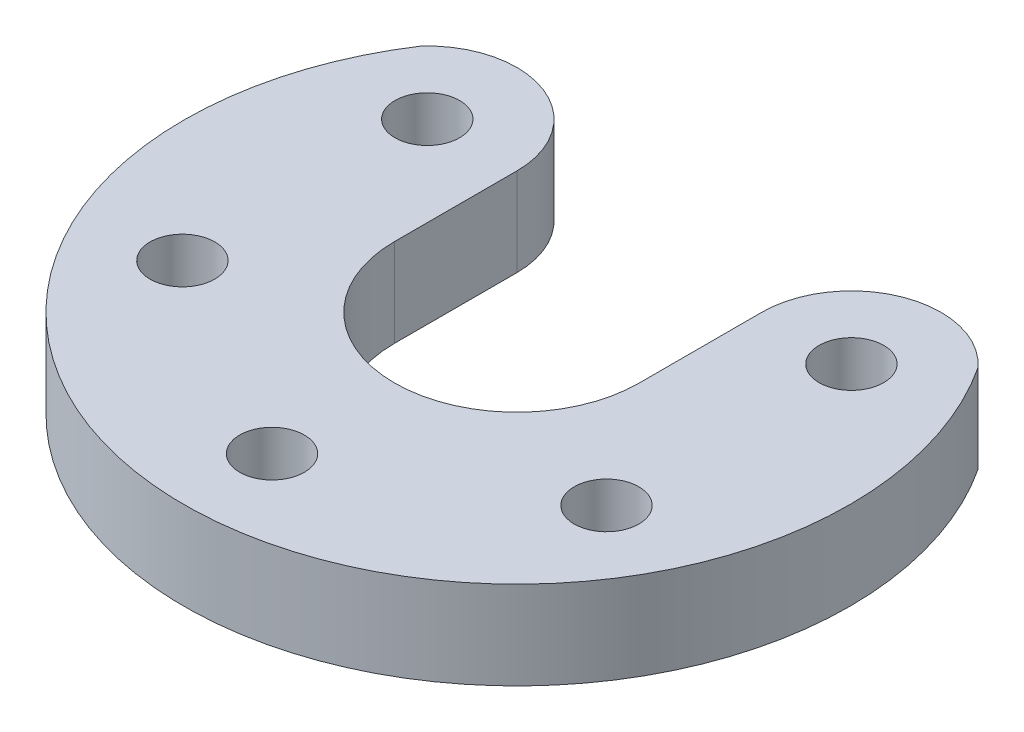
ISO-10303-21;
HEADER;
FILE_DESCRIPTION(('STEP AP214'),'2;1');
FILE_NAME('part.step','',(''),(''),'','','');
FILE_SCHEMA(('AUTOMOTIVE_DESIGN { 1 0 10303 214 1 1 1 1 }'));
ENDSEC;
DATA;
#1=APPLICATION_CONTEXT('core data for automotive mechanical design processes');
#2=APPLICATION_PROTOCOL_DEFINITION('international standard','automotive_design',2000,#1);
#3=PRODUCT_CONTEXT('',#1,'mechanical');
#4=PRODUCT('Part','Part','',(#3));
#5=PRODUCT_RELATED_PRODUCT_CATEGORY('part','',(#4));
#6=PRODUCT_DEFINITION_FORMATION('','',#4);
#7=PRODUCT_DEFINITION_CONTEXT('part definition',#1,'design');
#8=PRODUCT_DEFINITION('design','',#6,#7);
#9=PRODUCT_DEFINITION_SHAPE('','',#8);
#10=(LENGTH_UNIT() NAMED_UNIT(*) SI_UNIT(.MILLI.,.METRE.));
#11=(NAMED_UNIT(*) PLANE_ANGLE_UNIT() SI_UNIT($,.RADIAN.));
#12=(NAMED_UNIT(*) SI_UNIT($,.STERADIAN.) SOLID_ANGLE_UNIT());
#13=UNCERTAINTY_MEASURE_WITH_UNIT(LENGTH_MEASURE(1.E-05),#10,'distance_accuracy_value','');
#14=(GEOMETRIC_REPRESENTATION_CONTEXT(3) GLOBAL_UNCERTAINTY_ASSIGNED_CONTEXT((#13)) GLOBAL_UNIT_ASSIGNED_CONTEXT((#10,
#11,#12)) REPRESENTATION_CONTEXT('',''));
#15=CARTESIAN_POINT('',(0.,0.,0.));
#16=DIRECTION('',(0.,0.,1.));
#17=DIRECTION('',(1.,0.,0.));
#18=AXIS2_PLACEMENT_3D('',#15,#16,#17);
#19=CARTESIAN_POINT('',(0.,4.5,0.));
#20=DIRECTION('',(0.,-1.,0.));
#21=DIRECTION('',(0.,0.,-1.));
#22=AXIS2_PLACEMENT_3D('',#19,#20,#21);
#23=CYLINDRICAL_SURFACE('',#22,17.);
#24=CARTESIAN_POINT('',(0.,0.,0.));
#25=DIRECTION('',(0.,1.,0.));
#26=DIRECTION('',(0.,0.,1.));
#27=AXIS2_PLACEMENT_3D('',#24,#25,#26);
#28=CIRCLE('',#27,17.);
#29=CARTESIAN_POINT('',(-14.2168682682145,0.,-9.32097938224493));
#30=VERTEX_POINT('',#29);
#31=CARTESIAN_POINT('',(14.2168682682072,0.,-9.32097938225604));
#32=VERTEX_POINT('',#31);
#33=EDGE_CURVE('E138',#30,#32,#28,.T.);
#34=ORIENTED_EDGE('',*,*,#33,.T.);
#35=DIRECTION('',(0.,-1.,0.));
#36=VECTOR('',#35,1.);
#37=CARTESIAN_POINT('',(14.2168682682072,4.5,-9.32097938225604));
#38=LINE('',#37,#36);
#39=CARTESIAN_POINT('',(14.2168682682072,4.5,-9.32097938225604));
#40=VERTEX_POINT('',#39);
#41=EDGE_CURVE('E11',#40,#32,#38,.T.);
#42=ORIENTED_EDGE('',*,*,#41,.F.);
#43=CARTESIAN_POINT('',(0.,4.5,0.));
#44=DIRECTION('',(0.,1.,0.));
#45=DIRECTION('',(0.,0.,1.));
#46=AXIS2_PLACEMENT_3D('',#43,#44,#45);
#47=CIRCLE('',#46,17.);
#48=CARTESIAN_POINT('',(-14.2168682682145,4.5,-9.32097938224493));
#49=VERTEX_POINT('',#48);
#50=EDGE_CURVE('E164',#49,#40,#47,.T.);
#51=ORIENTED_EDGE('',*,*,#50,.F.);
#52=DIRECTION('',(0.,-1.,0.));
#53=VECTOR('',#52,1.);
#54=CARTESIAN_POINT('',(-14.2168682682145,4.5,-9.32097938224493));
#55=LINE('',#54,#53);
#56=EDGE_CURVE('E119',#49,#30,#55,.T.);
#57=ORIENTED_EDGE('',*,*,#56,.T.);
#58=EDGE_LOOP('',(#34,#42,#51,#57));
#59=FACE_BOUND('',#58,.T.);
#60=ADVANCED_FACE('F40',(#59),#23,.T.);
#61=CARTESIAN_POINT('',(10.8253175473058,4.5,-6.25000000000062));
#62=DIRECTION('',(0.,-1.,0.));
#63=DIRECTION('',(0.,0.,-1.));
#64=AXIS2_PLACEMENT_3D('',#61,#62,#63);
#65=CYLINDRICAL_SURFACE('',#64,4.57531754730583);
#66=CARTESIAN_POINT('',(10.8253175473058,0.,-6.25000000000062));
#67=DIRECTION('',(0.,1.,0.));
#68=DIRECTION('',(0.,0.,1.));
#69=AXIS2_PLACEMENT_3D('',#66,#67,#68);
#70=CIRCLE('',#69,4.57531754730583);
#71=CARTESIAN_POINT('',(6.25,0.,-6.25000000000062));
#72=VERTEX_POINT('',#71);
#73=EDGE_CURVE('E141',#32,#72,#70,.T.);
#74=ORIENTED_EDGE('',*,*,#73,.T.);
#75=DIRECTION('',(0.,-1.,0.));
#76=VECTOR('',#75,1.);
#77=CARTESIAN_POINT('',(6.25,4.5,-6.25000000000062));
#78=LINE('',#77,#76);
#79=CARTESIAN_POINT('',(6.25,4.5,-6.25000000000062));
#80=VERTEX_POINT('',#79);
#81=EDGE_CURVE('E49',#80,#72,#78,.T.);
#82=ORIENTED_EDGE('',*,*,#81,.F.);
#83=CARTESIAN_POINT('',(10.8253175473058,4.5,-6.25000000000062));
#84=DIRECTION('',(0.,1.,0.));
#85=DIRECTION('',(0.,0.,1.));
#86=AXIS2_PLACEMENT_3D('',#83,#84,#85);
#87=CIRCLE('',#86,4.57531754730583);
#88=EDGE_CURVE('E90',#40,#80,#87,.T.);
#89=ORIENTED_EDGE('',*,*,#88,.F.);
#90=ORIENTED_EDGE('',*,*,#41,.T.);
#91=EDGE_LOOP('',(#74,#82,#89,#90));
#92=FACE_BOUND('',#91,.T.);
#93=ADVANCED_FACE('F157',(#92),#65,.T.);
#94=CARTESIAN_POINT('',(6.25,4.5,0.));
#95=DIRECTION('',(-1.,0.,0.));
#96=DIRECTION('',(0.,0.,1.));
#97=AXIS2_PLACEMENT_3D('',#94,#95,#96);
#98=PLANE('',#97);
#99=DIRECTION('',(0.,0.,-1.));
#100=VECTOR('',#99,1.);
#101=CARTESIAN_POINT('',(6.25,0.,0.));
#102=LINE('',#101,#100);
#103=CARTESIAN_POINT('',(6.25,0.,0.));
#104=VERTEX_POINT('',#103);
#105=EDGE_CURVE('E144',#104,#72,#102,.T.);
#106=ORIENTED_EDGE('',*,*,#105,.F.);
#107=DIRECTION('',(0.,-1.,0.));
#108=VECTOR('',#107,1.);
#109=CARTESIAN_POINT('',(6.25,4.5,0.));
#110=LINE('',#109,#108);
#111=CARTESIAN_POINT('',(6.25,4.5,0.));
#112=VERTEX_POINT('',#111);
#113=EDGE_CURVE('E109',#112,#104,#110,.T.);
#114=ORIENTED_EDGE('',*,*,#113,.F.);
#115=DIRECTION('',(0.,0.,-1.));
#116=VECTOR('',#115,1.);
#117=CARTESIAN_POINT('',(6.25,4.5,0.));
#118=LINE('',#117,#116);
#119=EDGE_CURVE('E115',#112,#80,#118,.T.);
#120=ORIENTED_EDGE('',*,*,#119,.T.);
#121=ORIENTED_EDGE('',*,*,#81,.T.);
#122=EDGE_LOOP('',(#106,#114,#120,#121));
#123=FACE_BOUND('',#122,.T.);
#124=ADVANCED_FACE('F156',(#123),#98,.T.);
#125=CARTESIAN_POINT('',(0.,4.5,0.));
#126=DIRECTION('',(0.,-1.,0.));
#127=DIRECTION('',(0.,0.,-1.));
#128=AXIS2_PLACEMENT_3D('',#125,#126,#127);
#129=CYLINDRICAL_SURFACE('',#128,6.25);
#130=CARTESIAN_POINT('',(0.,0.,0.));
#131=DIRECTION('',(0.,1.,0.));
#132=DIRECTION('',(0.,0.,1.));
#133=AXIS2_PLACEMENT_3D('',#130,#131,#132);
#134=CIRCLE('',#133,6.25);
#135=CARTESIAN_POINT('',(-6.25,0.,0.));
#136=VERTEX_POINT('',#135);
#137=EDGE_CURVE('E104',#136,#104,#134,.T.);
#138=ORIENTED_EDGE('',*,*,#137,.F.);
#139=DIRECTION('',(0.,-1.,0.));
#140=VECTOR('',#139,1.);
#141=CARTESIAN_POINT('',(-6.25,4.5,0.));
#142=LINE('',#141,#140);
#143=CARTESIAN_POINT('',(-6.25,4.5,0.));
#144=VERTEX_POINT('',#143);
#145=EDGE_CURVE('E99',#144,#136,#142,.T.);
#146=ORIENTED_EDGE('',*,*,#145,.F.);
#147=CARTESIAN_POINT('',(0.,4.5,0.));
#148=DIRECTION('',(0.,1.,0.));
#149=DIRECTION('',(0.,0.,1.));
#150=AXIS2_PLACEMENT_3D('',#147,#148,#149);
#151=CIRCLE('',#150,6.25);
#152=EDGE_CURVE('E102',#144,#112,#151,.T.);
#153=ORIENTED_EDGE('',*,*,#152,.T.);
#154=ORIENTED_EDGE('',*,*,#113,.T.);
#155=EDGE_LOOP('',(#138,#146,#153,#154));
#156=FACE_BOUND('',#155,.T.);
#157=ADVANCED_FACE('F101',(#156),#129,.F.);
#158=CARTESIAN_POINT('',(-6.25,4.5,0.));
#159=DIRECTION('',(1.,0.,0.));
#160=DIRECTION('',(0.,0.,-1.));
#161=AXIS2_PLACEMENT_3D('',#158,#159,#160);
#162=PLANE('',#161);
#163=DIRECTION('',(0.,0.,1.));
#164=VECTOR('',#163,1.);
#165=CARTESIAN_POINT('',(-6.25,0.,0.));
#166=LINE('',#165,#164);
#167=CARTESIAN_POINT('',(-6.25,0.,-6.24999999999938));
#168=VERTEX_POINT('',#167);
#169=EDGE_CURVE('E148',#168,#136,#166,.T.);
#170=ORIENTED_EDGE('',*,*,#169,.F.);
#171=DIRECTION('',(0.,-1.,0.));
#172=VECTOR('',#171,1.);
#173=CARTESIAN_POINT('',(-6.25,4.5,-6.24999999999938));
#174=LINE('',#173,#172);
#175=CARTESIAN_POINT('',(-6.25,4.5,-6.24999999999938));
#176=VERTEX_POINT('',#175);
#177=EDGE_CURVE('E79',#176,#168,#174,.T.);
#178=ORIENTED_EDGE('',*,*,#177,.F.);
#179=DIRECTION('',(0.,0.,1.));
#180=VECTOR('',#179,1.);
#181=CARTESIAN_POINT('',(-6.25,4.5,0.));
#182=LINE('',#181,#180);
#183=EDGE_CURVE('E113',#176,#144,#182,.T.);
#184=ORIENTED_EDGE('',*,*,#183,.T.);
#185=ORIENTED_EDGE('',*,*,#145,.T.);
#186=EDGE_LOOP('',(#170,#178,#184,#185));
#187=FACE_BOUND('',#186,.T.);
#188=ADVANCED_FACE('F117',(#187),#162,.T.);
#189=CARTESIAN_POINT('',(-10.8253175473051,4.5,-6.24999999999938));
#190=DIRECTION('',(0.,-1.,0.));
#191=DIRECTION('',(0.,0.,-1.));
#192=AXIS2_PLACEMENT_3D('',#189,#190,#191);
#193=CYLINDRICAL_SURFACE('',#192,1.65000000000067);
#194=CARTESIAN_POINT('',(-10.8253175473051,4.5,-6.24999999999938));
#195=DIRECTION('',(0.,1.,0.));
#196=DIRECTION('',(0.,0.,1.));
#197=AXIS2_PLACEMENT_3D('',#194,#195,#196);
#198=CIRCLE('',#197,1.65000000000067);
#199=CARTESIAN_POINT('',(-10.8253175473051,4.5,-4.59999999999871));
#200=VERTEX_POINT('',#199);
#201=EDGE_CURVE('E326',#200,#200,#198,.T.);
#202=ORIENTED_EDGE('',*,*,#201,.T.);
#203=EDGE_LOOP('',(#202));
#204=FACE_BOUND('',#203,.T.);
#205=CARTESIAN_POINT('',(-10.8253175473051,0.,-6.24999999999938));
#206=DIRECTION('',(0.,1.,0.));
#207=DIRECTION('',(0.,0.,1.));
#208=AXIS2_PLACEMENT_3D('',#205,#206,#207);
#209=CIRCLE('',#208,1.65000000000067);
#210=CARTESIAN_POINT('',(-10.8253175473051,0.,-4.59999999999871));
#211=VERTEX_POINT('',#210);
#212=EDGE_CURVE('E135',#211,#211,#209,.T.);
#213=ORIENTED_EDGE('',*,*,#212,.F.);
#214=EDGE_LOOP('',(#213));
#215=FACE_BOUND('',#214,.T.);
#216=ADVANCED_FACE('F185',(#204,#215),#193,.F.);
#217=CARTESIAN_POINT('',(-10.8253175473044,4.5,6.25000000000062));
#218=DIRECTION('',(0.,-1.,0.));
#219=DIRECTION('',(0.,0.,-1.));
#220=AXIS2_PLACEMENT_3D('',#217,#218,#219);
#221=CYLINDRICAL_SURFACE('',#220,1.65000000000131);
#222=CARTESIAN_POINT('',(-10.8253175473044,4.5,6.25000000000062));
#223=DIRECTION('',(0.,1.,0.));
#224=DIRECTION('',(0.,0.,1.));
#225=AXIS2_PLACEMENT_3D('',#222,#223,#224);
#226=CIRCLE('',#225,1.65000000000131);
#227=CARTESIAN_POINT('',(-10.8253175473044,4.5,7.90000000000193));
#228=VERTEX_POINT('',#227);
#229=EDGE_CURVE('E319',#228,#228,#226,.T.);
#230=ORIENTED_EDGE('',*,*,#229,.T.);
#231=EDGE_LOOP('',(#230));
#232=FACE_BOUND('',#231,.T.);
#233=CARTESIAN_POINT('',(-10.8253175473044,0.,6.25000000000062));
#234=DIRECTION('',(0.,1.,0.));
#235=DIRECTION('',(0.,0.,1.));
#236=AXIS2_PLACEMENT_3D('',#233,#234,#235);
#237=CIRCLE('',#236,1.65000000000131);
#238=CARTESIAN_POINT('',(-10.8253175473044,0.,7.90000000000193));
#239=VERTEX_POINT('',#238);
#240=EDGE_CURVE('E132',#239,#239,#237,.T.);
#241=ORIENTED_EDGE('',*,*,#240,.F.);
#242=EDGE_LOOP('',(#241));
#243=FACE_BOUND('',#242,.T.);
#244=ADVANCED_FACE('F188',(#232,#243),#221,.F.);
#245=CARTESIAN_POINT('',(1.41802385452233E-12,4.5,12.5));
#246=DIRECTION('',(0.,-1.,0.));
#247=DIRECTION('',(0.,0.,-1.));
#248=AXIS2_PLACEMENT_3D('',#245,#246,#247);
#249=CYLINDRICAL_SURFACE('',#248,1.65000000000144);
#250=CARTESIAN_POINT('',(1.41802385452233E-12,4.5,12.5));
#251=DIRECTION('',(0.,1.,0.));
#252=DIRECTION('',(0.,0.,1.));
#253=AXIS2_PLACEMENT_3D('',#250,#251,#252);
#254=CIRCLE('',#253,1.65000000000144);
#255=CARTESIAN_POINT('',(1.41802385452233E-12,4.5,14.1500000000014));
#256=VERTEX_POINT('',#255);
#257=EDGE_CURVE('E316',#256,#256,#254,.T.);
#258=ORIENTED_EDGE('',*,*,#257,.T.);
#259=EDGE_LOOP('',(#258));
#260=FACE_BOUND('',#259,.T.);
#261=CARTESIAN_POINT('',(1.41802385452233E-12,0.,12.5));
#262=DIRECTION('',(0.,1.,0.));
#263=DIRECTION('',(0.,0.,1.));
#264=AXIS2_PLACEMENT_3D('',#261,#262,#263);
#265=CIRCLE('',#264,1.65000000000144);
#266=CARTESIAN_POINT('',(1.41802385452233E-12,0.,14.1500000000014));
#267=VERTEX_POINT('',#266);
#268=EDGE_CURVE('E129',#267,#267,#265,.T.);
#269=ORIENTED_EDGE('',*,*,#268,.F.);
#270=EDGE_LOOP('',(#269));
#271=FACE_BOUND('',#270,.T.);
#272=ADVANCED_FACE('F192',(#260,#271),#249,.F.);
#273=CARTESIAN_POINT('',(10.8253175473065,4.5,6.24999999999939));
#274=DIRECTION('',(0.,-1.,0.));
#275=DIRECTION('',(0.,0.,-1.));
#276=AXIS2_PLACEMENT_3D('',#273,#274,#275);
#277=CYLINDRICAL_SURFACE('',#276,1.6500000000009);
#278=CARTESIAN_POINT('',(10.8253175473065,4.5,6.24999999999939));
#279=DIRECTION('',(0.,1.,0.));
#280=DIRECTION('',(0.,0.,1.));
#281=AXIS2_PLACEMENT_3D('',#278,#279,#280);
#282=CIRCLE('',#281,1.6500000000009);
#283=CARTESIAN_POINT('',(10.8253175473065,4.5,7.90000000000028));
#284=VERTEX_POINT('',#283);
#285=EDGE_CURVE('E203',#284,#284,#282,.T.);
#286=ORIENTED_EDGE('',*,*,#285,.T.);
#287=EDGE_LOOP('',(#286));
#288=FACE_BOUND('',#287,.T.);
#289=CARTESIAN_POINT('',(10.8253175473065,0.,6.24999999999939));
#290=DIRECTION('',(0.,1.,0.));
#291=DIRECTION('',(0.,0.,1.));
#292=AXIS2_PLACEMENT_3D('',#289,#290,#291);
#293=CIRCLE('',#292,1.6500000000009);
#294=CARTESIAN_POINT('',(10.8253175473065,0.,7.90000000000028));
#295=VERTEX_POINT('',#294);
#296=EDGE_CURVE('E126',#295,#295,#293,.T.);
#297=ORIENTED_EDGE('',*,*,#296,.F.);
#298=EDGE_LOOP('',(#297));
#299=FACE_BOUND('',#298,.T.);
#300=ADVANCED_FACE('F174',(#288,#299),#277,.F.);
#301=CARTESIAN_POINT('',(10.8253175473058,4.5,-6.25000000000062));
#302=DIRECTION('',(0.,-1.,0.));
#303=DIRECTION('',(0.,0.,-1.));
#304=AXIS2_PLACEMENT_3D('',#301,#302,#303);
#305=CYLINDRICAL_SURFACE('',#304,1.65000000000019);
#306=CARTESIAN_POINT('',(10.8253175473058,4.5,-6.25000000000062));
#307=DIRECTION('',(0.,1.,0.));
#308=DIRECTION('',(0.,0.,1.));
#309=AXIS2_PLACEMENT_3D('',#306,#307,#308);
#310=CIRCLE('',#309,1.65000000000019);
#311=CARTESIAN_POINT('',(10.8253175473058,4.5,-4.60000000000043));
#312=VERTEX_POINT('',#311);
#313=EDGE_CURVE('E151',#312,#312,#310,.T.);
#314=ORIENTED_EDGE('',*,*,#313,.T.);
#315=EDGE_LOOP('',(#314));
#316=FACE_BOUND('',#315,.T.);
#317=CARTESIAN_POINT('',(10.8253175473058,0.,-6.25000000000062));
#318=DIRECTION('',(0.,1.,0.));
#319=DIRECTION('',(0.,0.,1.));
#320=AXIS2_PLACEMENT_3D('',#317,#318,#319);
#321=CIRCLE('',#320,1.65000000000019);
#322=CARTESIAN_POINT('',(10.8253175473058,0.,-4.60000000000043));
#323=VERTEX_POINT('',#322);
#324=EDGE_CURVE('E123',#323,#323,#321,.T.);
#325=ORIENTED_EDGE('',*,*,#324,.F.);
#326=EDGE_LOOP('',(#325));
#327=FACE_BOUND('',#326,.T.);
#328=ADVANCED_FACE('F42',(#316,#327),#305,.F.);
#329=CARTESIAN_POINT('',(-10.8253175473051,4.5,-6.24999999999938));
#330=DIRECTION('',(0.,-1.,0.));
#331=DIRECTION('',(0.,0.,-1.));
#332=AXIS2_PLACEMENT_3D('',#329,#330,#331);
#333=CYLINDRICAL_SURFACE('',#332,4.57531754730513);
#334=CARTESIAN_POINT('',(-10.8253175473051,0.,-6.24999999999938));
#335=DIRECTION('',(0.,1.,0.));
#336=DIRECTION('',(0.,0.,1.));
#337=AXIS2_PLACEMENT_3D('',#334,#335,#336);
#338=CIRCLE('',#337,4.57531754730513);
#339=EDGE_CURVE('E82',#168,#30,#338,.T.);
#340=ORIENTED_EDGE('',*,*,#339,.T.);
#341=ORIENTED_EDGE('',*,*,#56,.F.);
#342=CARTESIAN_POINT('',(-10.8253175473051,4.5,-6.24999999999938));
#343=DIRECTION('',(0.,1.,0.));
#344=DIRECTION('',(0.,0.,1.));
#345=AXIS2_PLACEMENT_3D('',#342,#343,#344);
#346=CIRCLE('',#345,4.57531754730513);
#347=EDGE_CURVE('E57',#176,#49,#346,.T.);
#348=ORIENTED_EDGE('',*,*,#347,.F.);
#349=ORIENTED_EDGE('',*,*,#177,.T.);
#350=EDGE_LOOP('',(#340,#341,#348,#349));
#351=FACE_BOUND('',#350,.T.);
#352=ADVANCED_FACE('F165',(#351),#333,.T.);
#353=CARTESIAN_POINT('',(0.,4.5,0.));
#354=DIRECTION('',(0.,1.,0.));
#355=DIRECTION('',(0.,0.,1.));
#356=AXIS2_PLACEMENT_3D('',#353,#354,#355);
#357=PLANE('',#356);
#358=ORIENTED_EDGE('',*,*,#313,.F.);
#359=EDGE_LOOP('',(#358));
#360=FACE_BOUND('',#359,.T.);
#361=ORIENTED_EDGE('',*,*,#285,.F.);
#362=EDGE_LOOP('',(#361));
#363=FACE_BOUND('',#362,.T.);
#364=ORIENTED_EDGE('',*,*,#257,.F.);
#365=EDGE_LOOP('',(#364));
#366=FACE_BOUND('',#365,.T.);
#367=ORIENTED_EDGE('',*,*,#229,.F.);
#368=EDGE_LOOP('',(#367));
#369=FACE_BOUND('',#368,.T.);
#370=ORIENTED_EDGE('',*,*,#201,.F.);
#371=EDGE_LOOP('',(#370));
#372=FACE_BOUND('',#371,.T.);
#373=ORIENTED_EDGE('',*,*,#50,.T.);
#374=ORIENTED_EDGE('',*,*,#88,.T.);
#375=ORIENTED_EDGE('',*,*,#119,.F.);
#376=ORIENTED_EDGE('',*,*,#152,.F.);
#377=ORIENTED_EDGE('',*,*,#183,.F.);
#378=ORIENTED_EDGE('',*,*,#347,.T.);
#379=EDGE_LOOP('',(#373,#374,#375,#376,#377,#378));
#380=FACE_BOUND('',#379,.T.);
#381=ADVANCED_FACE('F112',(#360,#363,#366,#369,#372,#380),#357,.T.);
#382=CARTESIAN_POINT('',(0.,0.,0.));
#383=DIRECTION('',(0.,1.,0.));
#384=DIRECTION('',(0.,0.,1.));
#385=AXIS2_PLACEMENT_3D('',#382,#383,#384);
#386=PLANE('',#385);
#387=ORIENTED_EDGE('',*,*,#324,.T.);
#388=EDGE_LOOP('',(#387));
#389=FACE_BOUND('',#388,.T.);
#390=ORIENTED_EDGE('',*,*,#296,.T.);
#391=EDGE_LOOP('',(#390));
#392=FACE_BOUND('',#391,.T.);
#393=ORIENTED_EDGE('',*,*,#268,.T.);
#394=EDGE_LOOP('',(#393));
#395=FACE_BOUND('',#394,.T.);
#396=ORIENTED_EDGE('',*,*,#240,.T.);
#397=EDGE_LOOP('',(#396));
#398=FACE_BOUND('',#397,.T.);
#399=ORIENTED_EDGE('',*,*,#212,.T.);
#400=EDGE_LOOP('',(#399));
#401=FACE_BOUND('',#400,.T.);
#402=ORIENTED_EDGE('',*,*,#33,.F.);
#403=ORIENTED_EDGE('',*,*,#339,.F.);
#404=ORIENTED_EDGE('',*,*,#169,.T.);
#405=ORIENTED_EDGE('',*,*,#137,.T.);
#406=ORIENTED_EDGE('',*,*,#105,.T.);
#407=ORIENTED_EDGE('',*,*,#73,.F.);
#408=EDGE_LOOP('',(#402,#403,#404,#405,#406,#407));
#409=FACE_BOUND('',#408,.T.);
#410=ADVANCED_FACE('F161',(#389,#392,#395,#398,#401,#409),#386,.F.);
#411=CLOSED_SHELL('',(#60,#93,#124,#157,#188,#216,#244,#272,#300,#328,#352,#381,#410));
#412=MANIFOLD_SOLID_BREP('B2',#411);
#413=ADVANCED_BREP_SHAPE_REPRESENTATION('',(#18,#412),#14);
#414=SHAPE_DEFINITION_REPRESENTATION(#9,#413);
ENDSEC;
END-ISO-10303-21;
